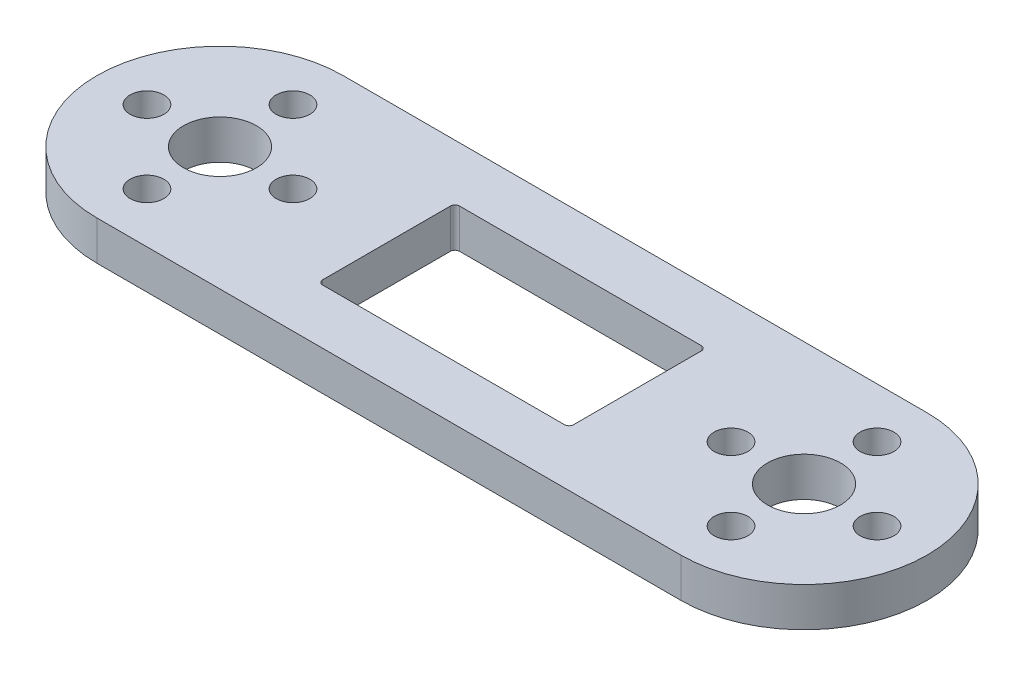
ISO-10303-21;
HEADER;
FILE_DESCRIPTION(('STEP AP214'),'2;1');
FILE_NAME('part.step','',(''),(''),'','','');
FILE_SCHEMA(('AUTOMOTIVE_DESIGN { 1 0 10303 214 1 1 1 1 }'));
ENDSEC;
DATA;
#1=APPLICATION_CONTEXT('core data for automotive mechanical design processes');
#2=APPLICATION_PROTOCOL_DEFINITION('international standard','automotive_design',2000,#1);
#3=PRODUCT_CONTEXT('',#1,'mechanical');
#4=PRODUCT('Part','Part','',(#3));
#5=PRODUCT_RELATED_PRODUCT_CATEGORY('part','',(#4));
#6=PRODUCT_DEFINITION_FORMATION('','',#4);
#7=PRODUCT_DEFINITION_CONTEXT('part definition',#1,'design');
#8=PRODUCT_DEFINITION('design','',#6,#7);
#9=PRODUCT_DEFINITION_SHAPE('','',#8);
#10=(LENGTH_UNIT() NAMED_UNIT(*) SI_UNIT(.MILLI.,.METRE.));
#11=(NAMED_UNIT(*) PLANE_ANGLE_UNIT() SI_UNIT($,.RADIAN.));
#12=(NAMED_UNIT(*) SI_UNIT($,.STERADIAN.) SOLID_ANGLE_UNIT());
#13=UNCERTAINTY_MEASURE_WITH_UNIT(LENGTH_MEASURE(1.E-05),#10,'distance_accuracy_value','');
#14=(GEOMETRIC_REPRESENTATION_CONTEXT(3) GLOBAL_UNCERTAINTY_ASSIGNED_CONTEXT((#13)) GLOBAL_UNIT_ASSIGNED_CONTEXT((#10,
#11,#12)) REPRESENTATION_CONTEXT('',''));
#15=CARTESIAN_POINT('',(0.,0.,0.));
#16=DIRECTION('',(0.,0.,1.));
#17=DIRECTION('',(1.,0.,0.));
#18=AXIS2_PLACEMENT_3D('',#15,#16,#17);
#19=CARTESIAN_POINT('',(-47.0130622440438,0.271407794310562,14.7934171156189));
#20=DIRECTION('',(0.,0.,-1.));
#21=DIRECTION('',(-1.,0.,0.));
#22=AXIS2_PLACEMENT_3D('',#19,#20,#21);
#23=PLANE('',#22);
#24=DIRECTION('',(1.,0.,0.));
#25=VECTOR('',#24,1.);
#26=CARTESIAN_POINT('',(-47.0130622440438,0.271407794310562,14.7934171156189));
#27=LINE('',#26,#25);
#28=CARTESIAN_POINT('',(-33.5130622440438,0.271407794310562,14.7934171156189));
#29=VERTEX_POINT('',#28);
#30=CARTESIAN_POINT('',(30.4869377559562,0.271407794310562,14.7934171156189));
#31=VERTEX_POINT('',#30);
#32=EDGE_CURVE('E339',#29,#31,#27,.T.);
#33=ORIENTED_EDGE('',*,*,#32,.F.);
#34=DIRECTION('',(0.,-1.,0.));
#35=VECTOR('',#34,1.);
#36=CARTESIAN_POINT('',(-33.5130622440438,0.271407794310562,14.7934171156189));
#37=LINE('',#36,#35);
#38=CARTESIAN_POINT('',(-33.5130622440438,-4.02859220568943,14.7934171156189));
#39=VERTEX_POINT('',#38);
#40=EDGE_CURVE('E29',#29,#39,#37,.T.);
#41=ORIENTED_EDGE('',*,*,#40,.T.);
#42=DIRECTION('',(-1.,0.,0.));
#43=VECTOR('',#42,1.);
#44=CARTESIAN_POINT('',(30.4869377559562,-4.02859220568943,14.7934171156189));
#45=LINE('',#44,#43);
#46=CARTESIAN_POINT('',(30.4869377559562,-4.02859220568943,14.7934171156189));
#47=VERTEX_POINT('',#46);
#48=EDGE_CURVE('E335',#47,#39,#45,.T.);
#49=ORIENTED_EDGE('',*,*,#48,.F.);
#50=DIRECTION('',(0.,-1.,0.));
#51=VECTOR('',#50,1.);
#52=CARTESIAN_POINT('',(30.4869377559562,0.271407794310562,14.7934171156189));
#53=LINE('',#52,#51);
#54=EDGE_CURVE('E347',#47,#31,#53,.F.);
#55=ORIENTED_EDGE('',*,*,#54,.T.);
#56=EDGE_LOOP('',(#33,#41,#49,#55));
#57=FACE_BOUND('',#56,.T.);
#58=ADVANCED_FACE('F19',(#57),#23,.F.);
#59=CARTESIAN_POINT('',(-47.0130622440438,0.271407794310562,-12.2065828843811));
#60=DIRECTION('',(0.,0.,1.));
#61=DIRECTION('',(1.,0.,0.));
#62=AXIS2_PLACEMENT_3D('',#59,#60,#61);
#63=PLANE('',#62);
#64=DIRECTION('',(0.,-1.,0.));
#65=VECTOR('',#64,1.);
#66=CARTESIAN_POINT('',(30.4869377559562,0.271407794310562,-12.2065828843811));
#67=LINE('',#66,#65);
#68=CARTESIAN_POINT('',(30.4869377559562,0.271407794310562,-12.2065828843811));
#69=VERTEX_POINT('',#68);
#70=CARTESIAN_POINT('',(30.4869377559562,-4.02859220568943,-12.2065828843811));
#71=VERTEX_POINT('',#70);
#72=EDGE_CURVE('E354',#69,#71,#67,.T.);
#73=ORIENTED_EDGE('',*,*,#72,.T.);
#74=DIRECTION('',(1.,0.,0.));
#75=VECTOR('',#74,1.);
#76=CARTESIAN_POINT('',(-33.5130622440438,-4.02859220568943,-12.2065828843811));
#77=LINE('',#76,#75);
#78=CARTESIAN_POINT('',(-33.5130622440438,-4.02859220568943,-12.2065828843811));
#79=VERTEX_POINT('',#78);
#80=EDGE_CURVE('E327',#79,#71,#77,.T.);
#81=ORIENTED_EDGE('',*,*,#80,.F.);
#82=DIRECTION('',(0.,-1.,0.));
#83=VECTOR('',#82,1.);
#84=CARTESIAN_POINT('',(-33.5130622440438,0.271407794310562,-12.2065828843811));
#85=LINE('',#84,#83);
#86=CARTESIAN_POINT('',(-33.5130622440438,0.271407794310562,-12.2065828843811));
#87=VERTEX_POINT('',#86);
#88=EDGE_CURVE('E361',#79,#87,#85,.F.);
#89=ORIENTED_EDGE('',*,*,#88,.T.);
#90=DIRECTION('',(-1.,0.,0.));
#91=VECTOR('',#90,1.);
#92=CARTESIAN_POINT('',(-47.0130622440438,0.271407794310562,-12.2065828843811));
#93=LINE('',#92,#91);
#94=EDGE_CURVE('E342',#69,#87,#93,.T.);
#95=ORIENTED_EDGE('',*,*,#94,.F.);
#96=EDGE_LOOP('',(#73,#81,#89,#95));
#97=FACE_BOUND('',#96,.T.);
#98=ADVANCED_FACE('F394',(#97),#63,.F.);
#99=CARTESIAN_POINT('',(-47.0130622440438,0.271407794310562,-12.2065828843811));
#100=DIRECTION('',(0.,-1.,0.));
#101=DIRECTION('',(0.,0.,-1.));
#102=AXIS2_PLACEMENT_3D('',#99,#100,#101);
#103=PLANE('',#102);
#104=DIRECTION('',(1.,0.,0.));
#105=VECTOR('',#104,1.);
#106=CARTESIAN_POINT('',(-15.2630622440438,0.271407794310562,8.79341711561892));
#107=LINE('',#106,#105);
#108=CARTESIAN_POINT('',(-14.7630622440438,0.271407794310562,8.79341711561892));
#109=VERTEX_POINT('',#108);
#110=CARTESIAN_POINT('',(11.7369377559562,0.271407794310562,8.79341711561892));
#111=VERTEX_POINT('',#110);
#112=EDGE_CURVE('E156',#109,#111,#107,.T.);
#113=ORIENTED_EDGE('',*,*,#112,.F.);
#114=CARTESIAN_POINT('',(-14.7630622440438,0.271407794310562,8.29341711561892));
#115=DIRECTION('',(0.,-1.,0.));
#116=DIRECTION('',(0.,0.,-1.));
#117=AXIS2_PLACEMENT_3D('',#114,#115,#116);
#118=CIRCLE('',#117,0.5);
#119=CARTESIAN_POINT('',(-15.2630622440438,0.271407794310562,8.29341711561892));
#120=VERTEX_POINT('',#119);
#121=EDGE_CURVE('E41',#109,#120,#118,.T.);
#122=ORIENTED_EDGE('',*,*,#121,.T.);
#123=DIRECTION('',(0.,0.,1.));
#124=VECTOR('',#123,1.);
#125=CARTESIAN_POINT('',(-15.2630622440438,0.271407794310562,-6.20658288438108));
#126=LINE('',#125,#124);
#127=CARTESIAN_POINT('',(-15.2630622440438,0.271407794310562,-5.70658288438108));
#128=VERTEX_POINT('',#127);
#129=EDGE_CURVE('E233',#128,#120,#126,.T.);
#130=ORIENTED_EDGE('',*,*,#129,.F.);
#131=CARTESIAN_POINT('',(-14.7630622440438,0.271407794310562,-5.70658288438108));
#132=DIRECTION('',(0.,-1.,0.));
#133=DIRECTION('',(0.,0.,-1.));
#134=AXIS2_PLACEMENT_3D('',#131,#132,#133);
#135=CIRCLE('',#134,0.5);
#136=CARTESIAN_POINT('',(-14.7630622440438,0.271407794310562,-6.20658288438108));
#137=VERTEX_POINT('',#136);
#138=EDGE_CURVE('E222',#128,#137,#135,.T.);
#139=ORIENTED_EDGE('',*,*,#138,.T.);
#140=DIRECTION('',(-1.,0.,0.));
#141=VECTOR('',#140,1.);
#142=CARTESIAN_POINT('',(-15.2630622440438,0.271407794310562,-6.20658288438108));
#143=LINE('',#142,#141);
#144=CARTESIAN_POINT('',(11.7369377559562,0.271407794310562,-6.20658288438108));
#145=VERTEX_POINT('',#144);
#146=EDGE_CURVE('E205',#145,#137,#143,.T.);
#147=ORIENTED_EDGE('',*,*,#146,.F.);
#148=CARTESIAN_POINT('',(11.7369377559562,0.271407794310562,-5.70658288438108));
#149=DIRECTION('',(0.,-1.,0.));
#150=DIRECTION('',(0.,0.,-1.));
#151=AXIS2_PLACEMENT_3D('',#148,#149,#150);
#152=CIRCLE('',#151,0.5);
#153=CARTESIAN_POINT('',(12.2369377559562,0.271407794310562,-5.70658288438108));
#154=VERTEX_POINT('',#153);
#155=EDGE_CURVE('E202',#145,#154,#152,.T.);
#156=ORIENTED_EDGE('',*,*,#155,.T.);
#157=DIRECTION('',(0.,0.,-1.));
#158=VECTOR('',#157,1.);
#159=CARTESIAN_POINT('',(12.2369377559562,0.271407794310562,-6.20658288438108));
#160=LINE('',#159,#158);
#161=CARTESIAN_POINT('',(12.2369377559562,0.271407794310562,8.29341711561892));
#162=VERTEX_POINT('',#161);
#163=EDGE_CURVE('E175',#162,#154,#160,.T.);
#164=ORIENTED_EDGE('',*,*,#163,.F.);
#165=CARTESIAN_POINT('',(11.7369377559562,0.271407794310562,8.29341711561892));
#166=DIRECTION('',(0.,-1.,0.));
#167=DIRECTION('',(0.,0.,-1.));
#168=AXIS2_PLACEMENT_3D('',#165,#166,#167);
#169=CIRCLE('',#168,0.5);
#170=EDGE_CURVE('E168',#162,#111,#169,.T.);
#171=ORIENTED_EDGE('',*,*,#170,.T.);
#172=EDGE_LOOP('',(#113,#122,#130,#139,#147,#156,#164,#171));
#173=FACE_BOUND('',#172,.T.);
#174=CARTESIAN_POINT('',(30.4869377559562,0.271407794310562,-6.70658288438108));
#175=DIRECTION('',(0.,1.,0.));
#176=DIRECTION('',(0.,0.,1.));
#177=AXIS2_PLACEMENT_3D('',#174,#175,#176);
#178=CIRCLE('',#177,1.84999999999999);
#179=CARTESIAN_POINT('',(30.4869377559562,0.271407794310562,-4.85658288438108));
#180=VERTEX_POINT('',#179);
#181=EDGE_CURVE('E243',#180,#180,#178,.T.);
#182=ORIENTED_EDGE('',*,*,#181,.F.);
#183=EDGE_LOOP('',(#182));
#184=FACE_BOUND('',#183,.T.);
#185=CARTESIAN_POINT('',(30.4869377559562,0.271407794310562,9.29341711561892));
#186=DIRECTION('',(0.,1.,0.));
#187=DIRECTION('',(0.,0.,1.));
#188=AXIS2_PLACEMENT_3D('',#185,#186,#187);
#189=CIRCLE('',#188,1.84999999999999);
#190=CARTESIAN_POINT('',(30.4869377559562,0.271407794310562,11.1434171156189));
#191=VERTEX_POINT('',#190);
#192=EDGE_CURVE('E251',#191,#191,#189,.T.);
#193=ORIENTED_EDGE('',*,*,#192,.F.);
#194=EDGE_LOOP('',(#193));
#195=FACE_BOUND('',#194,.T.);
#196=CARTESIAN_POINT('',(22.4869377559562,0.271407794310562,1.29341711561892));
#197=DIRECTION('',(0.,1.,0.));
#198=DIRECTION('',(0.,0.,1.));
#199=AXIS2_PLACEMENT_3D('',#196,#197,#198);
#200=CIRCLE('',#199,1.84999999999999);
#201=CARTESIAN_POINT('',(22.4869377559562,0.271407794310562,3.14341711561891));
#202=VERTEX_POINT('',#201);
#203=EDGE_CURVE('E259',#202,#202,#200,.T.);
#204=ORIENTED_EDGE('',*,*,#203,.F.);
#205=EDGE_LOOP('',(#204));
#206=FACE_BOUND('',#205,.T.);
#207=CARTESIAN_POINT('',(38.4869377559562,0.271407794310562,1.29341711561892));
#208=DIRECTION('',(0.,1.,0.));
#209=DIRECTION('',(0.,0.,1.));
#210=AXIS2_PLACEMENT_3D('',#207,#208,#209);
#211=CIRCLE('',#210,1.85);
#212=CARTESIAN_POINT('',(38.4869377559562,0.271407794310562,3.14341711561893));
#213=VERTEX_POINT('',#212);
#214=EDGE_CURVE('E267',#213,#213,#211,.T.);
#215=ORIENTED_EDGE('',*,*,#214,.F.);
#216=EDGE_LOOP('',(#215));
#217=FACE_BOUND('',#216,.T.);
#218=CARTESIAN_POINT('',(30.4869377559562,0.271407794310562,1.29341711561892));
#219=DIRECTION('',(0.,1.,0.));
#220=DIRECTION('',(0.,0.,1.));
#221=AXIS2_PLACEMENT_3D('',#218,#219,#220);
#222=CIRCLE('',#221,4.);
#223=CARTESIAN_POINT('',(30.4869377559562,0.271407794310562,5.29341711561893));
#224=VERTEX_POINT('',#223);
#225=EDGE_CURVE('E275',#224,#224,#222,.T.);
#226=ORIENTED_EDGE('',*,*,#225,.F.);
#227=EDGE_LOOP('',(#226));
#228=FACE_BOUND('',#227,.T.);
#229=CARTESIAN_POINT('',(-33.5130622440438,0.271407794310562,-6.70658288438108));
#230=DIRECTION('',(0.,1.,0.));
#231=DIRECTION('',(0.,0.,1.));
#232=AXIS2_PLACEMENT_3D('',#229,#230,#231);
#233=CIRCLE('',#232,1.85);
#234=CARTESIAN_POINT('',(-33.5130622440438,0.271407794310562,-4.85658288438108));
#235=VERTEX_POINT('',#234);
#236=EDGE_CURVE('E283',#235,#235,#233,.T.);
#237=ORIENTED_EDGE('',*,*,#236,.F.);
#238=EDGE_LOOP('',(#237));
#239=FACE_BOUND('',#238,.T.);
#240=CARTESIAN_POINT('',(-33.5130622440438,0.271407794310562,9.29341711561892));
#241=DIRECTION('',(0.,1.,0.));
#242=DIRECTION('',(0.,0.,1.));
#243=AXIS2_PLACEMENT_3D('',#240,#241,#242);
#244=CIRCLE('',#243,1.85);
#245=CARTESIAN_POINT('',(-33.5130622440438,0.271407794310562,11.1434171156189));
#246=VERTEX_POINT('',#245);
#247=EDGE_CURVE('E291',#246,#246,#244,.T.);
#248=ORIENTED_EDGE('',*,*,#247,.F.);
#249=EDGE_LOOP('',(#248));
#250=FACE_BOUND('',#249,.T.);
#251=CARTESIAN_POINT('',(-41.5130622440438,0.271407794310562,1.29341711561892));
#252=DIRECTION('',(0.,1.,0.));
#253=DIRECTION('',(0.,0.,1.));
#254=AXIS2_PLACEMENT_3D('',#251,#252,#253);
#255=CIRCLE('',#254,1.85);
#256=CARTESIAN_POINT('',(-41.5130622440438,0.271407794310562,3.14341711561892));
#257=VERTEX_POINT('',#256);
#258=EDGE_CURVE('E299',#257,#257,#255,.T.);
#259=ORIENTED_EDGE('',*,*,#258,.F.);
#260=EDGE_LOOP('',(#259));
#261=FACE_BOUND('',#260,.T.);
#262=CARTESIAN_POINT('',(-25.5130622440438,0.271407794310562,1.29341711561892));
#263=DIRECTION('',(0.,1.,0.));
#264=DIRECTION('',(0.,0.,1.));
#265=AXIS2_PLACEMENT_3D('',#262,#263,#264);
#266=CIRCLE('',#265,1.85);
#267=CARTESIAN_POINT('',(-25.5130622440438,0.271407794310562,3.14341711561892));
#268=VERTEX_POINT('',#267);
#269=EDGE_CURVE('E307',#268,#268,#266,.T.);
#270=ORIENTED_EDGE('',*,*,#269,.F.);
#271=EDGE_LOOP('',(#270));
#272=FACE_BOUND('',#271,.T.);
#273=CARTESIAN_POINT('',(-33.5130622440438,0.271407794310562,1.29341711561892));
#274=DIRECTION('',(0.,1.,0.));
#275=DIRECTION('',(0.,0.,1.));
#276=AXIS2_PLACEMENT_3D('',#273,#274,#275);
#277=CIRCLE('',#276,4.);
#278=CARTESIAN_POINT('',(-33.5130622440438,0.271407794310562,5.29341711561893));
#279=VERTEX_POINT('',#278);
#280=EDGE_CURVE('E315',#279,#279,#277,.T.);
#281=ORIENTED_EDGE('',*,*,#280,.F.);
#282=EDGE_LOOP('',(#281));
#283=FACE_BOUND('',#282,.T.);
#284=CARTESIAN_POINT('',(-33.5130622440438,0.271407794310562,1.29341711561892));
#285=DIRECTION('',(0.,-1.,0.));
#286=DIRECTION('',(0.,0.,-1.));
#287=AXIS2_PLACEMENT_3D('',#284,#285,#286);
#288=CIRCLE('',#287,13.5);
#289=CARTESIAN_POINT('',(-47.0130622440438,0.271407794310562,1.29341711561892));
#290=VERTEX_POINT('',#289);
#291=EDGE_CURVE('E364',#87,#290,#288,.F.);
#292=ORIENTED_EDGE('',*,*,#291,.T.);
#293=CARTESIAN_POINT('',(-33.5130622440438,0.271407794310562,1.29341711561892));
#294=DIRECTION('',(0.,-1.,0.));
#295=DIRECTION('',(0.,0.,-1.));
#296=AXIS2_PLACEMENT_3D('',#293,#294,#295);
#297=CIRCLE('',#296,13.5);
#298=EDGE_CURVE('E12',#290,#29,#297,.F.);
#299=ORIENTED_EDGE('',*,*,#298,.T.);
#300=ORIENTED_EDGE('',*,*,#32,.T.);
#301=CARTESIAN_POINT('',(30.4869377559562,0.271407794310562,1.29341711561892));
#302=DIRECTION('',(0.,-1.,0.));
#303=DIRECTION('',(0.,0.,-1.));
#304=AXIS2_PLACEMENT_3D('',#301,#302,#303);
#305=CIRCLE('',#304,13.5);
#306=CARTESIAN_POINT('',(43.9869377559562,0.271407794310562,1.29341711561892));
#307=VERTEX_POINT('',#306);
#308=EDGE_CURVE('E351',#31,#307,#305,.F.);
#309=ORIENTED_EDGE('',*,*,#308,.T.);
#310=CARTESIAN_POINT('',(30.4869377559562,0.271407794310562,1.29341711561892));
#311=DIRECTION('',(0.,-1.,0.));
#312=DIRECTION('',(0.,0.,-1.));
#313=AXIS2_PLACEMENT_3D('',#310,#311,#312);
#314=CIRCLE('',#313,13.5);
#315=EDGE_CURVE('E357',#307,#69,#314,.F.);
#316=ORIENTED_EDGE('',*,*,#315,.T.);
#317=ORIENTED_EDGE('',*,*,#94,.T.);
#318=EDGE_LOOP('',(#292,#299,#300,#309,#316,#317));
#319=FACE_BOUND('',#318,.T.);
#320=ADVANCED_FACE('F172',(#173,#184,#195,#206,#217,#228,#239,#250,#261,#272,#283,#319),#103,.F.);
#321=CARTESIAN_POINT('',(30.4869377559562,0.271407794310562,1.29341711561892));
#322=DIRECTION('',(0.,-1.,0.));
#323=DIRECTION('',(0.,0.,-1.));
#324=AXIS2_PLACEMENT_3D('',#321,#322,#323);
#325=CYLINDRICAL_SURFACE('',#324,13.5);
#326=ORIENTED_EDGE('',*,*,#308,.F.);
#327=ORIENTED_EDGE('',*,*,#54,.F.);
#328=CARTESIAN_POINT('',(30.4869377559562,-4.02859220568943,1.29341711561892));
#329=DIRECTION('',(0.,-1.,0.));
#330=DIRECTION('',(0.,0.,-1.));
#331=AXIS2_PLACEMENT_3D('',#328,#329,#330);
#332=CIRCLE('',#331,13.5);
#333=EDGE_CURVE('E323',#71,#47,#332,.T.);
#334=ORIENTED_EDGE('',*,*,#333,.F.);
#335=ORIENTED_EDGE('',*,*,#72,.F.);
#336=ORIENTED_EDGE('',*,*,#315,.F.);
#337=DIRECTION('',(0.,-1.,0.));
#338=VECTOR('',#337,1.);
#339=CARTESIAN_POINT('',(43.9869377559562,0.271407794310562,1.29341711561892));
#340=LINE('',#339,#338);
#341=CARTESIAN_POINT('',(43.9869377559562,-1.72859220568944,1.29341711561892));
#342=VERTEX_POINT('',#341);
#343=EDGE_CURVE('E346',#307,#342,#340,.T.);
#344=ORIENTED_EDGE('',*,*,#343,.T.);
#345=ORIENTED_EDGE('',*,*,#343,.F.);
#346=EDGE_LOOP('',(#326,#327,#334,#335,#336,#344,#345));
#347=FACE_BOUND('',#346,.T.);
#348=ADVANCED_FACE('F389',(#347),#325,.T.);
#349=CARTESIAN_POINT('',(-33.5130622440438,0.271407794310562,1.29341711561892));
#350=DIRECTION('',(0.,-1.,0.));
#351=DIRECTION('',(0.,0.,-1.));
#352=AXIS2_PLACEMENT_3D('',#349,#350,#351);
#353=CYLINDRICAL_SURFACE('',#352,13.5);
#354=ORIENTED_EDGE('',*,*,#291,.F.);
#355=ORIENTED_EDGE('',*,*,#88,.F.);
#356=CARTESIAN_POINT('',(-33.5130622440438,-4.02859220568943,1.29341711561892));
#357=DIRECTION('',(0.,-1.,0.));
#358=DIRECTION('',(0.,0.,-1.));
#359=AXIS2_PLACEMENT_3D('',#356,#357,#358);
#360=CIRCLE('',#359,13.5);
#361=EDGE_CURVE('E331',#39,#79,#360,.T.);
#362=ORIENTED_EDGE('',*,*,#361,.F.);
#363=ORIENTED_EDGE('',*,*,#40,.F.);
#364=ORIENTED_EDGE('',*,*,#298,.F.);
#365=DIRECTION('',(0.,-1.,0.));
#366=VECTOR('',#365,1.);
#367=CARTESIAN_POINT('',(-47.0130622440438,0.271407794310562,1.29341711561892));
#368=LINE('',#367,#366);
#369=CARTESIAN_POINT('',(-47.0130622440438,-1.72859220568944,1.29341711561892));
#370=VERTEX_POINT('',#369);
#371=EDGE_CURVE('E360',#290,#370,#368,.T.);
#372=ORIENTED_EDGE('',*,*,#371,.T.);
#373=ORIENTED_EDGE('',*,*,#371,.F.);
#374=EDGE_LOOP('',(#354,#355,#362,#363,#364,#372,#373));
#375=FACE_BOUND('',#374,.T.);
#376=ADVANCED_FACE('F21',(#375),#353,.T.);
#377=CARTESIAN_POINT('',(-47.0130622440438,-4.02859220568944,-12.2065828843811));
#378=DIRECTION('',(0.,-1.,0.));
#379=DIRECTION('',(0.,0.,-1.));
#380=AXIS2_PLACEMENT_3D('',#377,#378,#379);
#381=PLANE('',#380);
#382=CARTESIAN_POINT('',(-14.7630622440438,-4.02859220568943,8.29341711561892));
#383=DIRECTION('',(0.,-1.,0.));
#384=DIRECTION('',(0.,0.,-1.));
#385=AXIS2_PLACEMENT_3D('',#382,#383,#384);
#386=CIRCLE('',#385,0.5);
#387=CARTESIAN_POINT('',(-14.7630622440438,-4.02859220568943,8.79341711561892));
#388=VERTEX_POINT('',#387);
#389=CARTESIAN_POINT('',(-15.2630622440438,-4.02859220568943,8.29341711561892));
#390=VERTEX_POINT('',#389);
#391=EDGE_CURVE('E237',#388,#390,#386,.T.);
#392=ORIENTED_EDGE('',*,*,#391,.F.);
#393=DIRECTION('',(-1.,0.,0.));
#394=VECTOR('',#393,1.);
#395=CARTESIAN_POINT('',(11.7369377559562,-4.02859220568943,8.79341711561892));
#396=LINE('',#395,#394);
#397=CARTESIAN_POINT('',(11.7369377559562,-4.02859220568944,8.79341711561892));
#398=VERTEX_POINT('',#397);
#399=EDGE_CURVE('E164',#398,#388,#396,.T.);
#400=ORIENTED_EDGE('',*,*,#399,.F.);
#401=CARTESIAN_POINT('',(11.7369377559562,-4.02859220568943,8.29341711561892));
#402=DIRECTION('',(0.,-1.,0.));
#403=DIRECTION('',(0.,0.,-1.));
#404=AXIS2_PLACEMENT_3D('',#401,#402,#403);
#405=CIRCLE('',#404,0.5);
#406=CARTESIAN_POINT('',(12.2369377559562,-4.02859220568943,8.29341711561892));
#407=VERTEX_POINT('',#406);
#408=EDGE_CURVE('E51',#407,#398,#405,.T.);
#409=ORIENTED_EDGE('',*,*,#408,.F.);
#410=DIRECTION('',(0.,0.,1.));
#411=VECTOR('',#410,1.);
#412=CARTESIAN_POINT('',(12.2369377559562,-4.02859220568943,-5.70658288438108));
#413=LINE('',#412,#411);
#414=CARTESIAN_POINT('',(12.2369377559562,-4.02859220568943,-5.70658288438108));
#415=VERTEX_POINT('',#414);
#416=EDGE_CURVE('E191',#415,#407,#413,.T.);
#417=ORIENTED_EDGE('',*,*,#416,.F.);
#418=CARTESIAN_POINT('',(11.7369377559562,-4.02859220568943,-5.70658288438108));
#419=DIRECTION('',(0.,-1.,0.));
#420=DIRECTION('',(0.,0.,-1.));
#421=AXIS2_PLACEMENT_3D('',#418,#419,#420);
#422=CIRCLE('',#421,0.5);
#423=CARTESIAN_POINT('',(11.7369377559562,-4.02859220568943,-6.20658288438108));
#424=VERTEX_POINT('',#423);
#425=EDGE_CURVE('E198',#424,#415,#422,.T.);
#426=ORIENTED_EDGE('',*,*,#425,.F.);
#427=DIRECTION('',(1.,0.,0.));
#428=VECTOR('',#427,1.);
#429=CARTESIAN_POINT('',(-14.7630622440438,-4.02859220568943,-6.20658288438108));
#430=LINE('',#429,#428);
#431=CARTESIAN_POINT('',(-14.7630622440438,-4.02859220568943,-6.20658288438108));
#432=VERTEX_POINT('',#431);
#433=EDGE_CURVE('E211',#432,#424,#430,.T.);
#434=ORIENTED_EDGE('',*,*,#433,.F.);
#435=CARTESIAN_POINT('',(-14.7630622440438,-4.02859220568943,-5.70658288438108));
#436=DIRECTION('',(0.,-1.,0.));
#437=DIRECTION('',(0.,0.,-1.));
#438=AXIS2_PLACEMENT_3D('',#435,#436,#437);
#439=CIRCLE('',#438,0.5);
#440=CARTESIAN_POINT('',(-15.2630622440438,-4.02859220568943,-5.70658288438108));
#441=VERTEX_POINT('',#440);
#442=EDGE_CURVE('E218',#441,#432,#439,.T.);
#443=ORIENTED_EDGE('',*,*,#442,.F.);
#444=DIRECTION('',(0.,0.,-1.));
#445=VECTOR('',#444,1.);
#446=CARTESIAN_POINT('',(-15.2630622440438,-4.02859220568943,8.29341711561892));
#447=LINE('',#446,#445);
#448=EDGE_CURVE('E229',#390,#441,#447,.T.);
#449=ORIENTED_EDGE('',*,*,#448,.F.);
#450=EDGE_LOOP('',(#392,#400,#409,#417,#426,#434,#443,#449));
#451=FACE_BOUND('',#450,.T.);
#452=CARTESIAN_POINT('',(30.4869377559562,-4.02859220568943,-6.70658288438108));
#453=DIRECTION('',(0.,-1.,0.));
#454=DIRECTION('',(0.,0.,-1.));
#455=AXIS2_PLACEMENT_3D('',#452,#453,#454);
#456=CIRCLE('',#455,1.84999999999999);
#457=CARTESIAN_POINT('',(30.4869377559562,-4.02859220568943,-8.55658288438107));
#458=VERTEX_POINT('',#457);
#459=EDGE_CURVE('E247',#458,#458,#456,.T.);
#460=ORIENTED_EDGE('',*,*,#459,.F.);
#461=EDGE_LOOP('',(#460));
#462=FACE_BOUND('',#461,.T.);
#463=CARTESIAN_POINT('',(30.4869377559562,-4.02859220568943,9.29341711561892));
#464=DIRECTION('',(0.,-1.,0.));
#465=DIRECTION('',(0.,0.,-1.));
#466=AXIS2_PLACEMENT_3D('',#463,#464,#465);
#467=CIRCLE('',#466,1.84999999999999);
#468=CARTESIAN_POINT('',(30.4869377559562,-4.02859220568943,7.44341711561893));
#469=VERTEX_POINT('',#468);
#470=EDGE_CURVE('E255',#469,#469,#467,.T.);
#471=ORIENTED_EDGE('',*,*,#470,.F.);
#472=EDGE_LOOP('',(#471));
#473=FACE_BOUND('',#472,.T.);
#474=CARTESIAN_POINT('',(22.4869377559562,-4.02859220568943,1.29341711561892));
#475=DIRECTION('',(0.,-1.,0.));
#476=DIRECTION('',(0.,0.,-1.));
#477=AXIS2_PLACEMENT_3D('',#474,#475,#476);
#478=CIRCLE('',#477,1.84999999999999);
#479=CARTESIAN_POINT('',(22.4869377559562,-4.02859220568943,-0.556582884381067));
#480=VERTEX_POINT('',#479);
#481=EDGE_CURVE('E263',#480,#480,#478,.T.);
#482=ORIENTED_EDGE('',*,*,#481,.F.);
#483=EDGE_LOOP('',(#482));
#484=FACE_BOUND('',#483,.T.);
#485=CARTESIAN_POINT('',(38.4869377559562,-4.02859220568943,1.29341711561892));
#486=DIRECTION('',(0.,-1.,0.));
#487=DIRECTION('',(0.,0.,-1.));
#488=AXIS2_PLACEMENT_3D('',#485,#486,#487);
#489=CIRCLE('',#488,1.85);
#490=CARTESIAN_POINT('',(38.4869377559562,-4.02859220568943,-0.556582884381081));
#491=VERTEX_POINT('',#490);
#492=EDGE_CURVE('E271',#491,#491,#489,.T.);
#493=ORIENTED_EDGE('',*,*,#492,.F.);
#494=EDGE_LOOP('',(#493));
#495=FACE_BOUND('',#494,.T.);
#496=CARTESIAN_POINT('',(30.4869377559562,-4.02859220568943,1.29341711561892));
#497=DIRECTION('',(0.,-1.,0.));
#498=DIRECTION('',(0.,0.,-1.));
#499=AXIS2_PLACEMENT_3D('',#496,#497,#498);
#500=CIRCLE('',#499,4.00000000000001);
#501=CARTESIAN_POINT('',(30.4869377559562,-4.02859220568943,-2.70658288438108));
#502=VERTEX_POINT('',#501);
#503=EDGE_CURVE('E279',#502,#502,#500,.T.);
#504=ORIENTED_EDGE('',*,*,#503,.F.);
#505=EDGE_LOOP('',(#504));
#506=FACE_BOUND('',#505,.T.);
#507=CARTESIAN_POINT('',(-33.5130622440438,-4.02859220568943,-6.70658288438108));
#508=DIRECTION('',(0.,-1.,0.));
#509=DIRECTION('',(0.,0.,-1.));
#510=AXIS2_PLACEMENT_3D('',#507,#508,#509);
#511=CIRCLE('',#510,1.85);
#512=CARTESIAN_POINT('',(-33.5130622440438,-4.02859220568943,-8.55658288438107));
#513=VERTEX_POINT('',#512);
#514=EDGE_CURVE('E287',#513,#513,#511,.T.);
#515=ORIENTED_EDGE('',*,*,#514,.F.);
#516=EDGE_LOOP('',(#515));
#517=FACE_BOUND('',#516,.T.);
#518=CARTESIAN_POINT('',(-33.5130622440438,-4.02859220568943,9.29341711561892));
#519=DIRECTION('',(0.,-1.,0.));
#520=DIRECTION('',(0.,0.,-1.));
#521=AXIS2_PLACEMENT_3D('',#518,#519,#520);
#522=CIRCLE('',#521,1.85);
#523=CARTESIAN_POINT('',(-33.5130622440438,-4.02859220568943,7.44341711561893));
#524=VERTEX_POINT('',#523);
#525=EDGE_CURVE('E295',#524,#524,#522,.T.);
#526=ORIENTED_EDGE('',*,*,#525,.F.);
#527=EDGE_LOOP('',(#526));
#528=FACE_BOUND('',#527,.T.);
#529=CARTESIAN_POINT('',(-41.5130622440438,-4.02859220568943,1.29341711561892));
#530=DIRECTION('',(0.,-1.,0.));
#531=DIRECTION('',(0.,0.,-1.));
#532=AXIS2_PLACEMENT_3D('',#529,#530,#531);
#533=CIRCLE('',#532,1.85);
#534=CARTESIAN_POINT('',(-41.5130622440438,-4.02859220568943,-0.556582884381074));
#535=VERTEX_POINT('',#534);
#536=EDGE_CURVE('E303',#535,#535,#533,.T.);
#537=ORIENTED_EDGE('',*,*,#536,.F.);
#538=EDGE_LOOP('',(#537));
#539=FACE_BOUND('',#538,.T.);
#540=CARTESIAN_POINT('',(-25.5130622440438,-4.02859220568943,1.29341711561892));
#541=DIRECTION('',(0.,-1.,0.));
#542=DIRECTION('',(0.,0.,-1.));
#543=AXIS2_PLACEMENT_3D('',#540,#541,#542);
#544=CIRCLE('',#543,1.85);
#545=CARTESIAN_POINT('',(-25.5130622440438,-4.02859220568943,-0.556582884381074));
#546=VERTEX_POINT('',#545);
#547=EDGE_CURVE('E311',#546,#546,#544,.T.);
#548=ORIENTED_EDGE('',*,*,#547,.F.);
#549=EDGE_LOOP('',(#548));
#550=FACE_BOUND('',#549,.T.);
#551=CARTESIAN_POINT('',(-33.5130622440438,-4.02859220568943,1.29341711561892));
#552=DIRECTION('',(0.,-1.,0.));
#553=DIRECTION('',(0.,0.,-1.));
#554=AXIS2_PLACEMENT_3D('',#551,#552,#553);
#555=CIRCLE('',#554,4.);
#556=CARTESIAN_POINT('',(-33.5130622440438,-4.02859220568943,-2.70658288438108));
#557=VERTEX_POINT('',#556);
#558=EDGE_CURVE('E319',#557,#557,#555,.T.);
#559=ORIENTED_EDGE('',*,*,#558,.F.);
#560=EDGE_LOOP('',(#559));
#561=FACE_BOUND('',#560,.T.);
#562=ORIENTED_EDGE('',*,*,#333,.T.);
#563=ORIENTED_EDGE('',*,*,#48,.T.);
#564=ORIENTED_EDGE('',*,*,#361,.T.);
#565=ORIENTED_EDGE('',*,*,#80,.T.);
#566=EDGE_LOOP('',(#562,#563,#564,#565));
#567=FACE_BOUND('',#566,.T.);
#568=ADVANCED_FACE('F397',(#451,#462,#473,#484,#495,#506,#517,#528,#539,#550,#561,#567),#381,.T.);
#569=CARTESIAN_POINT('',(-33.5130622440438,-1.72859220568944,1.29341711561892));
#570=DIRECTION('',(0.,1.,0.));
#571=DIRECTION('',(0.,0.,1.));
#572=AXIS2_PLACEMENT_3D('',#569,#570,#571);
#573=CYLINDRICAL_SURFACE('',#572,4.);
#574=ORIENTED_EDGE('',*,*,#280,.T.);
#575=EDGE_LOOP('',(#574));
#576=FACE_BOUND('',#575,.T.);
#577=ORIENTED_EDGE('',*,*,#558,.T.);
#578=EDGE_LOOP('',(#577));
#579=FACE_BOUND('',#578,.T.);
#580=ADVANCED_FACE('F399',(#576,#579),#573,.F.);
#581=CARTESIAN_POINT('',(-25.5130622440438,-1.72859220568944,1.29341711561892));
#582=DIRECTION('',(0.,1.,0.));
#583=DIRECTION('',(0.,0.,1.));
#584=AXIS2_PLACEMENT_3D('',#581,#582,#583);
#585=CYLINDRICAL_SURFACE('',#584,1.85);
#586=ORIENTED_EDGE('',*,*,#269,.T.);
#587=EDGE_LOOP('',(#586));
#588=FACE_BOUND('',#587,.T.);
#589=ORIENTED_EDGE('',*,*,#547,.T.);
#590=EDGE_LOOP('',(#589));
#591=FACE_BOUND('',#590,.T.);
#592=ADVANCED_FACE('F407',(#588,#591),#585,.F.);
#593=CARTESIAN_POINT('',(-41.5130622440438,-1.72859220568944,1.29341711561892));
#594=DIRECTION('',(0.,1.,0.));
#595=DIRECTION('',(0.,0.,1.));
#596=AXIS2_PLACEMENT_3D('',#593,#594,#595);
#597=CYLINDRICAL_SURFACE('',#596,1.85);
#598=ORIENTED_EDGE('',*,*,#258,.T.);
#599=EDGE_LOOP('',(#598));
#600=FACE_BOUND('',#599,.T.);
#601=ORIENTED_EDGE('',*,*,#536,.T.);
#602=EDGE_LOOP('',(#601));
#603=FACE_BOUND('',#602,.T.);
#604=ADVANCED_FACE('F480',(#600,#603),#597,.F.);
#605=CARTESIAN_POINT('',(-33.5130622440438,-1.72859220568944,9.29341711561892));
#606=DIRECTION('',(0.,1.,0.));
#607=DIRECTION('',(0.,0.,1.));
#608=AXIS2_PLACEMENT_3D('',#605,#606,#607);
#609=CYLINDRICAL_SURFACE('',#608,1.85);
#610=ORIENTED_EDGE('',*,*,#247,.T.);
#611=EDGE_LOOP('',(#610));
#612=FACE_BOUND('',#611,.T.);
#613=ORIENTED_EDGE('',*,*,#525,.T.);
#614=EDGE_LOOP('',(#613));
#615=FACE_BOUND('',#614,.T.);
#616=ADVANCED_FACE('F492',(#612,#615),#609,.F.);
#617=CARTESIAN_POINT('',(-33.5130622440438,-1.72859220568944,-6.70658288438108));
#618=DIRECTION('',(0.,1.,0.));
#619=DIRECTION('',(0.,0.,1.));
#620=AXIS2_PLACEMENT_3D('',#617,#618,#619);
#621=CYLINDRICAL_SURFACE('',#620,1.85);
#622=ORIENTED_EDGE('',*,*,#236,.T.);
#623=EDGE_LOOP('',(#622));
#624=FACE_BOUND('',#623,.T.);
#625=ORIENTED_EDGE('',*,*,#514,.T.);
#626=EDGE_LOOP('',(#625));
#627=FACE_BOUND('',#626,.T.);
#628=ADVANCED_FACE('F504',(#624,#627),#621,.F.);
#629=CARTESIAN_POINT('',(30.4869377559562,-1.72859220568944,1.29341711561892));
#630=DIRECTION('',(0.,1.,0.));
#631=DIRECTION('',(0.,0.,1.));
#632=AXIS2_PLACEMENT_3D('',#629,#630,#631);
#633=CYLINDRICAL_SURFACE('',#632,4.);
#634=ORIENTED_EDGE('',*,*,#225,.T.);
#635=EDGE_LOOP('',(#634));
#636=FACE_BOUND('',#635,.T.);
#637=ORIENTED_EDGE('',*,*,#503,.T.);
#638=EDGE_LOOP('',(#637));
#639=FACE_BOUND('',#638,.T.);
#640=ADVANCED_FACE('F516',(#636,#639),#633,.F.);
#641=CARTESIAN_POINT('',(38.4869377559562,-1.72859220568944,1.29341711561892));
#642=DIRECTION('',(0.,1.,0.));
#643=DIRECTION('',(0.,0.,1.));
#644=AXIS2_PLACEMENT_3D('',#641,#642,#643);
#645=CYLINDRICAL_SURFACE('',#644,1.85);
#646=ORIENTED_EDGE('',*,*,#214,.T.);
#647=EDGE_LOOP('',(#646));
#648=FACE_BOUND('',#647,.T.);
#649=ORIENTED_EDGE('',*,*,#492,.T.);
#650=EDGE_LOOP('',(#649));
#651=FACE_BOUND('',#650,.T.);
#652=ADVANCED_FACE('F528',(#648,#651),#645,.F.);
#653=CARTESIAN_POINT('',(22.4869377559562,-1.72859220568944,1.29341711561892));
#654=DIRECTION('',(0.,1.,0.));
#655=DIRECTION('',(0.,0.,1.));
#656=AXIS2_PLACEMENT_3D('',#653,#654,#655);
#657=CYLINDRICAL_SURFACE('',#656,1.84999999999999);
#658=ORIENTED_EDGE('',*,*,#203,.T.);
#659=EDGE_LOOP('',(#658));
#660=FACE_BOUND('',#659,.T.);
#661=ORIENTED_EDGE('',*,*,#481,.T.);
#662=EDGE_LOOP('',(#661));
#663=FACE_BOUND('',#662,.T.);
#664=ADVANCED_FACE('F540',(#660,#663),#657,.F.);
#665=CARTESIAN_POINT('',(30.4869377559562,-1.72859220568944,9.29341711561892));
#666=DIRECTION('',(0.,1.,0.));
#667=DIRECTION('',(0.,0.,1.));
#668=AXIS2_PLACEMENT_3D('',#665,#666,#667);
#669=CYLINDRICAL_SURFACE('',#668,1.84999999999999);
#670=ORIENTED_EDGE('',*,*,#192,.T.);
#671=EDGE_LOOP('',(#670));
#672=FACE_BOUND('',#671,.T.);
#673=ORIENTED_EDGE('',*,*,#470,.T.);
#674=EDGE_LOOP('',(#673));
#675=FACE_BOUND('',#674,.T.);
#676=ADVANCED_FACE('F552',(#672,#675),#669,.F.);
#677=CARTESIAN_POINT('',(30.4869377559562,-1.72859220568944,-6.70658288438108));
#678=DIRECTION('',(0.,1.,0.));
#679=DIRECTION('',(0.,0.,1.));
#680=AXIS2_PLACEMENT_3D('',#677,#678,#679);
#681=CYLINDRICAL_SURFACE('',#680,1.84999999999999);
#682=ORIENTED_EDGE('',*,*,#181,.T.);
#683=EDGE_LOOP('',(#682));
#684=FACE_BOUND('',#683,.T.);
#685=ORIENTED_EDGE('',*,*,#459,.T.);
#686=EDGE_LOOP('',(#685));
#687=FACE_BOUND('',#686,.T.);
#688=ADVANCED_FACE('F564',(#684,#687),#681,.F.);
#689=CARTESIAN_POINT('',(-14.7630622440438,-1.72859220568944,8.29341711561892));
#690=DIRECTION('',(0.,-1.,0.));
#691=DIRECTION('',(0.,0.,-1.));
#692=AXIS2_PLACEMENT_3D('',#689,#690,#691);
#693=CYLINDRICAL_SURFACE('',#692,0.5);
#694=DIRECTION('',(0.,1.,0.));
#695=VECTOR('',#694,1.);
#696=CARTESIAN_POINT('',(-14.7630622440438,0.271407794310562,8.79341711561892));
#697=LINE('',#696,#695);
#698=EDGE_CURVE('E160',#388,#109,#697,.T.);
#699=ORIENTED_EDGE('',*,*,#698,.F.);
#700=ORIENTED_EDGE('',*,*,#391,.T.);
#701=DIRECTION('',(0.,1.,0.));
#702=VECTOR('',#701,1.);
#703=CARTESIAN_POINT('',(-15.2630622440438,-1.72859220568944,8.29341711561892));
#704=LINE('',#703,#702);
#705=EDGE_CURVE('E226',#120,#390,#704,.F.);
#706=ORIENTED_EDGE('',*,*,#705,.F.);
#707=ORIENTED_EDGE('',*,*,#121,.F.);
#708=EDGE_LOOP('',(#699,#700,#706,#707));
#709=FACE_BOUND('',#708,.T.);
#710=ADVANCED_FACE('F576',(#709),#693,.F.);
#711=CARTESIAN_POINT('',(-15.2630622440438,-1.72859220568944,-6.20658288438108));
#712=DIRECTION('',(-1.,0.,0.));
#713=DIRECTION('',(0.,0.,1.));
#714=AXIS2_PLACEMENT_3D('',#711,#712,#713);
#715=PLANE('',#714);
#716=ORIENTED_EDGE('',*,*,#705,.T.);
#717=ORIENTED_EDGE('',*,*,#448,.T.);
#718=DIRECTION('',(0.,1.,0.));
#719=VECTOR('',#718,1.);
#720=CARTESIAN_POINT('',(-15.2630622440438,0.271407794310562,-5.70658288438108));
#721=LINE('',#720,#719);
#722=EDGE_CURVE('E215',#441,#128,#721,.T.);
#723=ORIENTED_EDGE('',*,*,#722,.T.);
#724=ORIENTED_EDGE('',*,*,#129,.T.);
#725=EDGE_LOOP('',(#716,#717,#723,#724));
#726=FACE_BOUND('',#725,.T.);
#727=ADVANCED_FACE('F588',(#726),#715,.F.);
#728=CARTESIAN_POINT('',(-14.7630622440438,-1.72859220568944,-5.70658288438108));
#729=DIRECTION('',(0.,-1.,0.));
#730=DIRECTION('',(0.,0.,-1.));
#731=AXIS2_PLACEMENT_3D('',#728,#729,#730);
#732=CYLINDRICAL_SURFACE('',#731,0.5);
#733=ORIENTED_EDGE('',*,*,#722,.F.);
#734=ORIENTED_EDGE('',*,*,#442,.T.);
#735=DIRECTION('',(0.,1.,0.));
#736=VECTOR('',#735,1.);
#737=CARTESIAN_POINT('',(-14.7630622440438,-1.72859220568944,-6.20658288438108));
#738=LINE('',#737,#736);
#739=EDGE_CURVE('E208',#137,#432,#738,.F.);
#740=ORIENTED_EDGE('',*,*,#739,.F.);
#741=ORIENTED_EDGE('',*,*,#138,.F.);
#742=EDGE_LOOP('',(#733,#734,#740,#741));
#743=FACE_BOUND('',#742,.T.);
#744=ADVANCED_FACE('F599',(#743),#732,.F.);
#745=CARTESIAN_POINT('',(-15.2630622440438,-1.72859220568944,-6.20658288438108));
#746=DIRECTION('',(0.,0.,-1.));
#747=DIRECTION('',(-1.,0.,0.));
#748=AXIS2_PLACEMENT_3D('',#745,#746,#747);
#749=PLANE('',#748);
#750=ORIENTED_EDGE('',*,*,#146,.T.);
#751=ORIENTED_EDGE('',*,*,#739,.T.);
#752=ORIENTED_EDGE('',*,*,#433,.T.);
#753=DIRECTION('',(0.,1.,0.));
#754=VECTOR('',#753,1.);
#755=CARTESIAN_POINT('',(11.7369377559562,0.271407794310562,-6.20658288438108));
#756=LINE('',#755,#754);
#757=EDGE_CURVE('E195',#424,#145,#756,.T.);
#758=ORIENTED_EDGE('',*,*,#757,.T.);
#759=EDGE_LOOP('',(#750,#751,#752,#758));
#760=FACE_BOUND('',#759,.T.);
#761=ADVANCED_FACE('F611',(#760),#749,.F.);
#762=CARTESIAN_POINT('',(11.7369377559562,-1.72859220568944,-5.70658288438108));
#763=DIRECTION('',(0.,-1.,0.));
#764=DIRECTION('',(0.,0.,-1.));
#765=AXIS2_PLACEMENT_3D('',#762,#763,#764);
#766=CYLINDRICAL_SURFACE('',#765,0.5);
#767=ORIENTED_EDGE('',*,*,#757,.F.);
#768=ORIENTED_EDGE('',*,*,#425,.T.);
#769=DIRECTION('',(0.,1.,0.));
#770=VECTOR('',#769,1.);
#771=CARTESIAN_POINT('',(12.2369377559562,-1.72859220568944,-5.70658288438108));
#772=LINE('',#771,#770);
#773=EDGE_CURVE('E182',#154,#415,#772,.F.);
#774=ORIENTED_EDGE('',*,*,#773,.F.);
#775=ORIENTED_EDGE('',*,*,#155,.F.);
#776=EDGE_LOOP('',(#767,#768,#774,#775));
#777=FACE_BOUND('',#776,.T.);
#778=ADVANCED_FACE('F623',(#777),#766,.F.);
#779=CARTESIAN_POINT('',(12.2369377559562,-1.72859220568944,-6.20658288438108));
#780=DIRECTION('',(1.,0.,0.));
#781=DIRECTION('',(0.,0.,-1.));
#782=AXIS2_PLACEMENT_3D('',#779,#780,#781);
#783=PLANE('',#782);
#784=ORIENTED_EDGE('',*,*,#163,.T.);
#785=ORIENTED_EDGE('',*,*,#773,.T.);
#786=ORIENTED_EDGE('',*,*,#416,.T.);
#787=DIRECTION('',(0.,1.,0.));
#788=VECTOR('',#787,1.);
#789=CARTESIAN_POINT('',(12.2369377559562,0.271407794310562,8.29341711561892));
#790=LINE('',#789,#788);
#791=EDGE_CURVE('E185',#407,#162,#790,.T.);
#792=ORIENTED_EDGE('',*,*,#791,.T.);
#793=EDGE_LOOP('',(#784,#785,#786,#792));
#794=FACE_BOUND('',#793,.T.);
#795=ADVANCED_FACE('F635',(#794),#783,.F.);
#796=CARTESIAN_POINT('',(11.7369377559562,-1.72859220568944,8.29341711561892));
#797=DIRECTION('',(0.,-1.,0.));
#798=DIRECTION('',(0.,0.,-1.));
#799=AXIS2_PLACEMENT_3D('',#796,#797,#798);
#800=CYLINDRICAL_SURFACE('',#799,0.5);
#801=ORIENTED_EDGE('',*,*,#791,.F.);
#802=ORIENTED_EDGE('',*,*,#408,.T.);
#803=DIRECTION('',(0.,1.,0.));
#804=VECTOR('',#803,1.);
#805=CARTESIAN_POINT('',(11.7369377559562,-1.72859220568944,8.79341711561892));
#806=LINE('',#805,#804);
#807=EDGE_CURVE('E158',#111,#398,#806,.F.);
#808=ORIENTED_EDGE('',*,*,#807,.F.);
#809=ORIENTED_EDGE('',*,*,#170,.F.);
#810=EDGE_LOOP('',(#801,#802,#808,#809));
#811=FACE_BOUND('',#810,.T.);
#812=ADVANCED_FACE('F167',(#811),#800,.F.);
#813=CARTESIAN_POINT('',(-15.2630622440438,-1.72859220568944,8.79341711561892));
#814=DIRECTION('',(0.,0.,1.));
#815=DIRECTION('',(1.,0.,0.));
#816=AXIS2_PLACEMENT_3D('',#813,#814,#815);
#817=PLANE('',#816);
#818=ORIENTED_EDGE('',*,*,#112,.T.);
#819=ORIENTED_EDGE('',*,*,#807,.T.);
#820=ORIENTED_EDGE('',*,*,#399,.T.);
#821=ORIENTED_EDGE('',*,*,#698,.T.);
#822=EDGE_LOOP('',(#818,#819,#820,#821));
#823=FACE_BOUND('',#822,.T.);
#824=ADVANCED_FACE('F157',(#823),#817,.F.);
#825=CLOSED_SHELL('',(#58,#98,#320,#348,#376,#568,#580,#592,#604,#616,#628,#640,#652,#664,#676,
#688,#710,#727,#744,#761,#778,#795,#812,#824));
#826=MANIFOLD_SOLID_BREP('B1',#825);
#827=ADVANCED_BREP_SHAPE_REPRESENTATION('',(#18,#826),#14);
#828=SHAPE_DEFINITION_REPRESENTATION(#9,#827);
ENDSEC;
END-ISO-10303-21;
